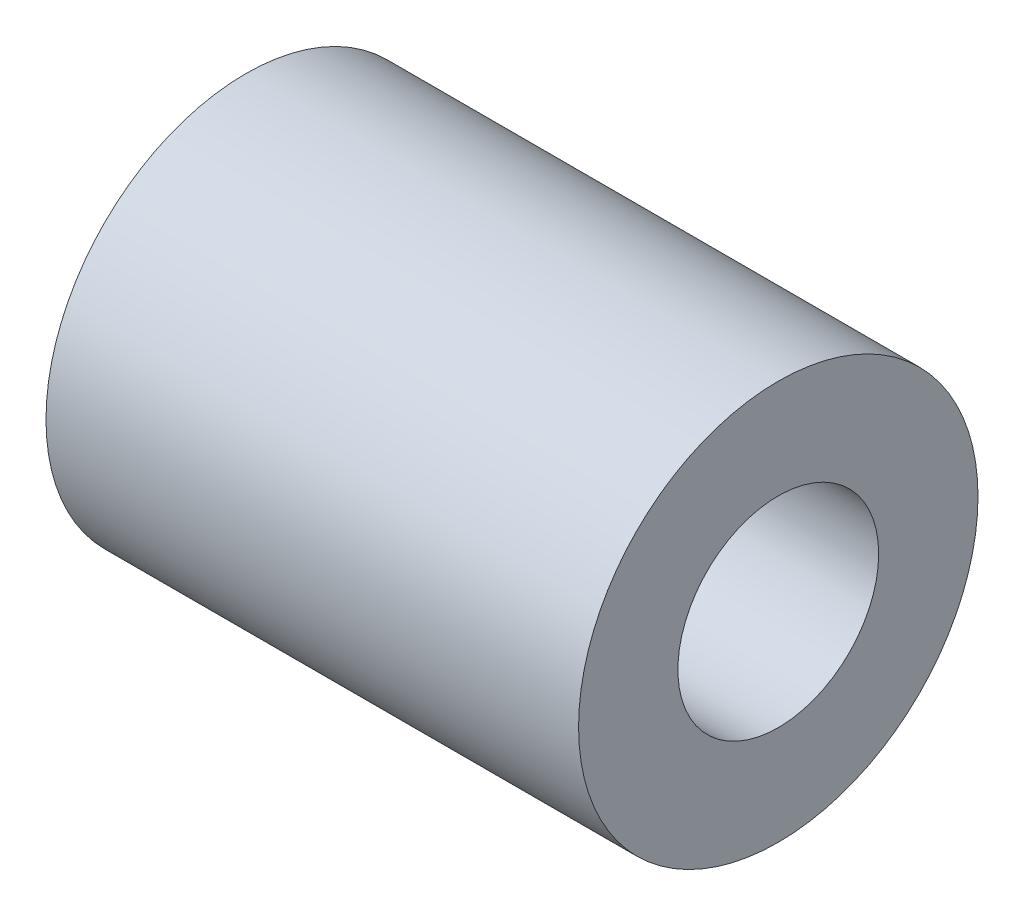
ISO-10303-21;
HEADER;
FILE_DESCRIPTION(('STEP AP214'),'2;1');
FILE_NAME('part.step','',(''),(''),'','','');
FILE_SCHEMA(('AUTOMOTIVE_DESIGN { 1 0 10303 214 1 1 1 1 }'));
ENDSEC;
DATA;
#1=APPLICATION_CONTEXT('core data for automotive mechanical design processes');
#2=APPLICATION_PROTOCOL_DEFINITION('international standard','automotive_design',2000,#1);
#3=PRODUCT_CONTEXT('',#1,'mechanical');
#4=PRODUCT('Part','Part','',(#3));
#5=PRODUCT_RELATED_PRODUCT_CATEGORY('part','',(#4));
#6=PRODUCT_DEFINITION_FORMATION('','',#4);
#7=PRODUCT_DEFINITION_CONTEXT('part definition',#1,'design');
#8=PRODUCT_DEFINITION('design','',#6,#7);
#9=PRODUCT_DEFINITION_SHAPE('','',#8);
#10=(LENGTH_UNIT() NAMED_UNIT(*) SI_UNIT(.MILLI.,.METRE.));
#11=(NAMED_UNIT(*) PLANE_ANGLE_UNIT() SI_UNIT($,.RADIAN.));
#12=(NAMED_UNIT(*) SI_UNIT($,.STERADIAN.) SOLID_ANGLE_UNIT());
#13=UNCERTAINTY_MEASURE_WITH_UNIT(LENGTH_MEASURE(1.E-05),#10,'distance_accuracy_value','');
#14=(GEOMETRIC_REPRESENTATION_CONTEXT(3) GLOBAL_UNCERTAINTY_ASSIGNED_CONTEXT((#13)) GLOBAL_UNIT_ASSIGNED_CONTEXT((#10,
#11,#12)) REPRESENTATION_CONTEXT('',''));
#15=CARTESIAN_POINT('',(0.,0.,0.));
#16=DIRECTION('',(0.,0.,1.));
#17=DIRECTION('',(1.,0.,0.));
#18=AXIS2_PLACEMENT_3D('',#15,#16,#17);
#19=CARTESIAN_POINT('',(25.4,0.,0.));
#20=DIRECTION('',(1.,0.,0.));
#21=DIRECTION('',(0.,0.,-1.));
#22=AXIS2_PLACEMENT_3D('',#19,#20,#21);
#23=PLANE('',#22);
#24=CARTESIAN_POINT('',(25.4,0.,0.));
#25=DIRECTION('',(1.,0.,0.));
#26=DIRECTION('',(0.,0.,-1.));
#27=AXIS2_PLACEMENT_3D('',#24,#25,#26);
#28=CIRCLE('',#27,9.525);
#29=CARTESIAN_POINT('',(25.4,0.,-9.525));
#30=VERTEX_POINT('',#29);
#31=EDGE_CURVE('E10',#30,#30,#28,.T.);
#32=ORIENTED_EDGE('',*,*,#31,.T.);
#33=EDGE_LOOP('',(#32));
#34=FACE_BOUND('',#33,.T.);
#35=CARTESIAN_POINT('',(25.4,0.,0.));
#36=DIRECTION('',(1.,0.,0.));
#37=DIRECTION('',(0.,0.,-1.));
#38=AXIS2_PLACEMENT_3D('',#35,#36,#37);
#39=CIRCLE('',#38,4.7879);
#40=CARTESIAN_POINT('',(25.4,0.,-4.7879));
#41=VERTEX_POINT('',#40);
#42=EDGE_CURVE('E42',#41,#41,#39,.T.);
#43=ORIENTED_EDGE('',*,*,#42,.F.);
#44=EDGE_LOOP('',(#43));
#45=FACE_BOUND('',#44,.T.);
#46=ADVANCED_FACE('F31',(#34,#45),#23,.T.);
#47=CARTESIAN_POINT('',(0.,0.,0.));
#48=DIRECTION('',(1.,0.,0.));
#49=DIRECTION('',(0.,0.,-1.));
#50=AXIS2_PLACEMENT_3D('',#47,#48,#49);
#51=PLANE('',#50);
#52=CARTESIAN_POINT('',(0.,0.,0.));
#53=DIRECTION('',(1.,0.,0.));
#54=DIRECTION('',(0.,0.,-1.));
#55=AXIS2_PLACEMENT_3D('',#52,#53,#54);
#56=CIRCLE('',#55,9.525);
#57=CARTESIAN_POINT('',(0.,0.,-9.525));
#58=VERTEX_POINT('',#57);
#59=EDGE_CURVE('E35',#58,#58,#56,.T.);
#60=ORIENTED_EDGE('',*,*,#59,.F.);
#61=EDGE_LOOP('',(#60));
#62=FACE_BOUND('',#61,.T.);
#63=CARTESIAN_POINT('',(0.,0.,0.));
#64=DIRECTION('',(1.,0.,0.));
#65=DIRECTION('',(0.,0.,-1.));
#66=AXIS2_PLACEMENT_3D('',#63,#64,#65);
#67=CIRCLE('',#66,4.7879);
#68=CARTESIAN_POINT('',(0.,0.,-4.7879));
#69=VERTEX_POINT('',#68);
#70=EDGE_CURVE('E44',#69,#69,#67,.T.);
#71=ORIENTED_EDGE('',*,*,#70,.T.);
#72=EDGE_LOOP('',(#71));
#73=FACE_BOUND('',#72,.T.);
#74=ADVANCED_FACE('F54',(#62,#73),#51,.F.);
#75=CARTESIAN_POINT('',(25.4,0.,0.));
#76=DIRECTION('',(-1.,0.,0.));
#77=DIRECTION('',(0.,0.,1.));
#78=AXIS2_PLACEMENT_3D('',#75,#76,#77);
#79=CYLINDRICAL_SURFACE('',#78,9.525);
#80=ORIENTED_EDGE('',*,*,#31,.F.);
#81=EDGE_LOOP('',(#80));
#82=FACE_BOUND('',#81,.T.);
#83=ORIENTED_EDGE('',*,*,#59,.T.);
#84=EDGE_LOOP('',(#83));
#85=FACE_BOUND('',#84,.T.);
#86=ADVANCED_FACE('F33',(#82,#85),#79,.T.);
#87=CARTESIAN_POINT('',(25.4,0.,0.));
#88=DIRECTION('',(-1.,0.,0.));
#89=DIRECTION('',(0.,0.,1.));
#90=AXIS2_PLACEMENT_3D('',#87,#88,#89);
#91=CYLINDRICAL_SURFACE('',#90,4.7879);
#92=ORIENTED_EDGE('',*,*,#42,.T.);
#93=EDGE_LOOP('',(#92));
#94=FACE_BOUND('',#93,.T.);
#95=ORIENTED_EDGE('',*,*,#70,.F.);
#96=EDGE_LOOP('',(#95));
#97=FACE_BOUND('',#96,.T.);
#98=ADVANCED_FACE('F50',(#94,#97),#91,.F.);
#99=CLOSED_SHELL('',(#46,#74,#86,#98));
#100=MANIFOLD_SOLID_BREP('B2',#99);
#101=ADVANCED_BREP_SHAPE_REPRESENTATION('',(#18,#100),#14);
#102=SHAPE_DEFINITION_REPRESENTATION(#9,#101);
ENDSEC;
END-ISO-10303-21;
